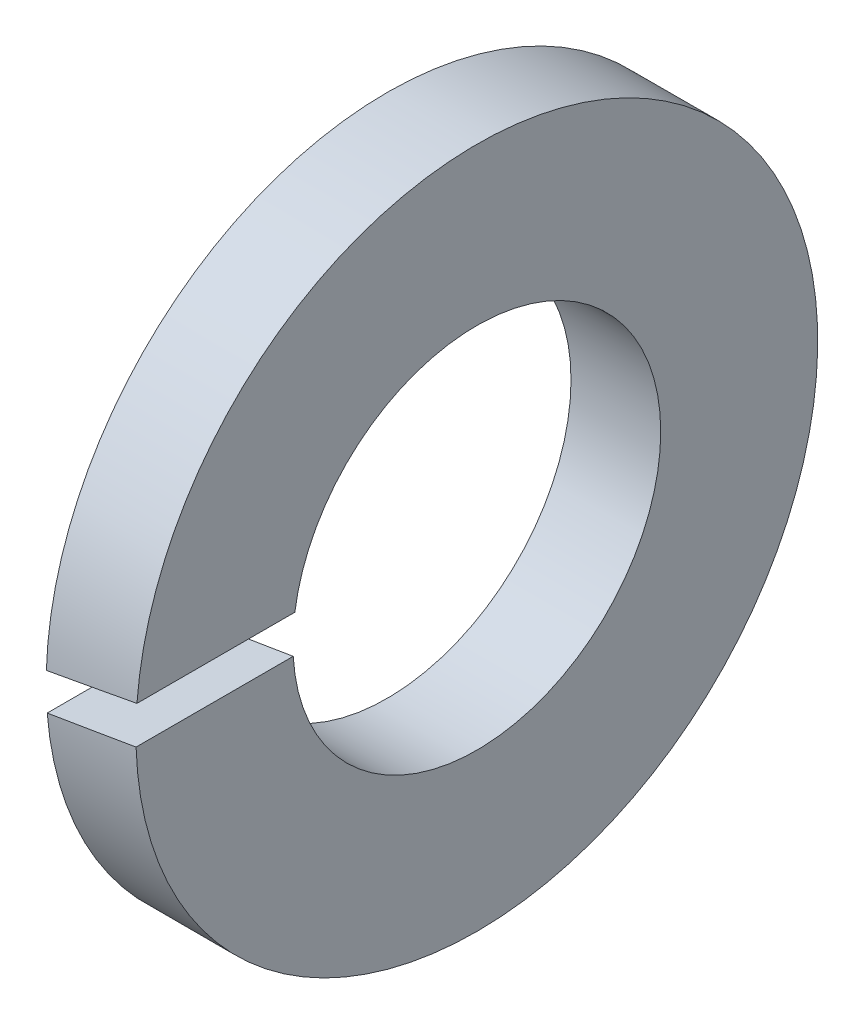
ISO-10303-21;
HEADER;
FILE_DESCRIPTION(('STEP AP214'),'2;1');
FILE_NAME('part.step','',(''),(''),'','','');
FILE_SCHEMA(('AUTOMOTIVE_DESIGN { 1 0 10303 214 1 1 1 1 }'));
ENDSEC;
DATA;
#1=APPLICATION_CONTEXT('core data for automotive mechanical design processes');
#2=APPLICATION_PROTOCOL_DEFINITION('international standard','automotive_design',2000,#1);
#3=PRODUCT_CONTEXT('',#1,'mechanical');
#4=PRODUCT('Part','Part','',(#3));
#5=PRODUCT_RELATED_PRODUCT_CATEGORY('part','',(#4));
#6=PRODUCT_DEFINITION_FORMATION('','',#4);
#7=PRODUCT_DEFINITION_CONTEXT('part definition',#1,'design');
#8=PRODUCT_DEFINITION('design','',#6,#7);
#9=PRODUCT_DEFINITION_SHAPE('','',#8);
#10=(LENGTH_UNIT() NAMED_UNIT(*) SI_UNIT(.MILLI.,.METRE.));
#11=(NAMED_UNIT(*) PLANE_ANGLE_UNIT() SI_UNIT($,.RADIAN.));
#12=(NAMED_UNIT(*) SI_UNIT($,.STERADIAN.) SOLID_ANGLE_UNIT());
#13=UNCERTAINTY_MEASURE_WITH_UNIT(LENGTH_MEASURE(1.E-05),#10,'distance_accuracy_value','');
#14=(GEOMETRIC_REPRESENTATION_CONTEXT(3) GLOBAL_UNCERTAINTY_ASSIGNED_CONTEXT((#13)) GLOBAL_UNIT_ASSIGNED_CONTEXT((#10,
#11,#12)) REPRESENTATION_CONTEXT('',''));
#15=CARTESIAN_POINT('',(0.,0.,0.));
#16=DIRECTION('',(0.,0.,1.));
#17=DIRECTION('',(1.,0.,0.));
#18=AXIS2_PLACEMENT_3D('',#15,#16,#17);
#19=CARTESIAN_POINT('',(0.5,2.925,0.));
#20=DIRECTION('',(1.,0.,0.));
#21=DIRECTION('',(0.,0.,-1.));
#22=AXIS2_PLACEMENT_3D('',#19,#20,#21);
#23=PLANE('',#22);
#24=CARTESIAN_POINT('',(0.5,0.,0.));
#25=DIRECTION('',(1.,0.,0.));
#26=DIRECTION('',(0.,0.,-1.));
#27=AXIS2_PLACEMENT_3D('',#24,#25,#26);
#28=CIRCLE('',#27,3.8);
#29=CARTESIAN_POINT('',(0.5,0.29632594579081,3.78842855731122));
#30=VERTEX_POINT('',#29);
#31=CARTESIAN_POINT('',(0.5,-0.119998965082345,3.79810482324793));
#32=VERTEX_POINT('',#31);
#33=EDGE_CURVE('E68',#30,#32,#28,.F.);
#34=ORIENTED_EDGE('',*,*,#33,.F.);
#35=DIRECTION('',(0.,0.,1.));
#36=VECTOR('',#35,1.);
#37=CARTESIAN_POINT('',(0.5,0.29632594579081,0.));
#38=LINE('',#37,#36);
#39=CARTESIAN_POINT('',(0.5,0.29632594579081,2.028470096859));
#40=VERTEX_POINT('',#39);
#41=EDGE_CURVE('E63',#30,#40,#38,.F.);
#42=ORIENTED_EDGE('',*,*,#41,.T.);
#43=CARTESIAN_POINT('',(0.5,0.,0.));
#44=DIRECTION('',(1.,0.,0.));
#45=DIRECTION('',(0.,0.,-1.));
#46=AXIS2_PLACEMENT_3D('',#43,#44,#45);
#47=CIRCLE('',#46,2.05);
#48=CARTESIAN_POINT('',(0.5,-0.119998965082345,2.04648485173459));
#49=VERTEX_POINT('',#48);
#50=EDGE_CURVE('E67',#40,#49,#47,.F.);
#51=ORIENTED_EDGE('',*,*,#50,.T.);
#52=DIRECTION('',(0.,0.,1.));
#53=VECTOR('',#52,1.);
#54=CARTESIAN_POINT('',(0.5,-0.119998965082345,0.));
#55=LINE('',#54,#53);
#56=EDGE_CURVE('E83',#49,#32,#55,.T.);
#57=ORIENTED_EDGE('',*,*,#56,.T.);
#58=EDGE_LOOP('',(#34,#42,#51,#57));
#59=FACE_BOUND('',#58,.T.);
#60=ADVANCED_FACE('F18',(#59),#23,.T.);
#61=CARTESIAN_POINT('',(-1.02040562943393,0.0282374117005723,0.));
#62=DIRECTION('',(-0.17364817766693,0.984807753012208,0.));
#63=DIRECTION('',(-0.984807753012208,-0.17364817766693,0.));
#64=AXIS2_PLACEMENT_3D('',#61,#62,#63);
#65=PLANE('',#64);
#66=CARTESIAN_POINT('',(-1.18054794904445,0.,0.));
#67=DIRECTION('',(-0.17364817766693,0.984807753012208,0.));
#68=DIRECTION('',(0.984807753012208,0.17364817766693,0.));
#69=AXIS2_PLACEMENT_3D('',#66,#67,#68);
#70=ELLIPSE('',#69,21.8833278359458,3.8);
#71=CARTESIAN_POINT('',(-0.5,0.119998965082345,3.79810482324793));
#72=VERTEX_POINT('',#71);
#73=EDGE_CURVE('E21',#72,#30,#70,.T.);
#74=ORIENTED_EDGE('',*,*,#73,.F.);
#75=DIRECTION('',(0.,0.,1.));
#76=VECTOR('',#75,1.);
#77=CARTESIAN_POINT('',(-0.5,0.119998965082345,0.));
#78=LINE('',#77,#76);
#79=CARTESIAN_POINT('',(-0.5,0.119998965082345,2.04648485173459));
#80=VERTEX_POINT('',#79);
#81=EDGE_CURVE('E73',#80,#72,#78,.T.);
#82=ORIENTED_EDGE('',*,*,#81,.F.);
#83=CARTESIAN_POINT('',(-1.18054794904445,0.,0.));
#84=DIRECTION('',(-0.17364817766693,0.984807753012208,0.));
#85=DIRECTION('',(0.984807753012208,0.17364817766693,0.));
#86=AXIS2_PLACEMENT_3D('',#83,#84,#85);
#87=ELLIPSE('',#86,11.8054794904445,2.05);
#88=EDGE_CURVE('E71',#80,#40,#87,.T.);
#89=ORIENTED_EDGE('',*,*,#88,.T.);
#90=ORIENTED_EDGE('',*,*,#41,.F.);
#91=EDGE_LOOP('',(#74,#82,#89,#90));
#92=FACE_BOUND('',#91,.T.);
#93=ADVANCED_FACE('F72',(#92),#65,.F.);
#94=CARTESIAN_POINT('',(0.,0.,0.));
#95=DIRECTION('',(1.,0.,0.));
#96=DIRECTION('',(0.,0.,-1.));
#97=AXIS2_PLACEMENT_3D('',#94,#95,#96);
#98=CYLINDRICAL_SURFACE('',#97,3.8);
#99=CARTESIAN_POINT('',(1.18054794904445,0.,0.));
#100=DIRECTION('',(0.17364817766693,-0.984807753012208,0.));
#101=DIRECTION('',(0.984807753012208,0.17364817766693,0.));
#102=AXIS2_PLACEMENT_3D('',#99,#100,#101);
#103=ELLIPSE('',#102,21.8833278359458,3.8);
#104=CARTESIAN_POINT('',(-0.5,-0.29632594579081,3.78842855731122));
#105=VERTEX_POINT('',#104);
#106=EDGE_CURVE('E84',#32,#105,#103,.T.);
#107=ORIENTED_EDGE('',*,*,#106,.T.);
#108=CARTESIAN_POINT('',(-0.5,0.,0.));
#109=DIRECTION('',(1.,0.,0.));
#110=DIRECTION('',(0.,0.,-1.));
#111=AXIS2_PLACEMENT_3D('',#108,#109,#110);
#112=CIRCLE('',#111,3.8);
#113=EDGE_CURVE('E78',#72,#105,#112,.F.);
#114=ORIENTED_EDGE('',*,*,#113,.F.);
#115=ORIENTED_EDGE('',*,*,#73,.T.);
#116=ORIENTED_EDGE('',*,*,#33,.T.);
#117=EDGE_LOOP('',(#107,#114,#115,#116));
#118=FACE_BOUND('',#117,.T.);
#119=ADVANCED_FACE('F92',(#118),#98,.T.);
#120=CARTESIAN_POINT('',(1.02040562943393,-0.0282374117005723,0.));
#121=DIRECTION('',(0.17364817766693,-0.984807753012208,0.));
#122=DIRECTION('',(0.984807753012208,0.17364817766693,0.));
#123=AXIS2_PLACEMENT_3D('',#120,#121,#122);
#124=PLANE('',#123);
#125=CARTESIAN_POINT('',(1.18054794904445,0.,0.));
#126=DIRECTION('',(0.17364817766693,-0.984807753012208,0.));
#127=DIRECTION('',(0.984807753012208,0.17364817766693,0.));
#128=AXIS2_PLACEMENT_3D('',#125,#126,#127);
#129=ELLIPSE('',#128,11.8054794904445,2.05);
#130=CARTESIAN_POINT('',(-0.5,-0.29632594579081,2.028470096859));
#131=VERTEX_POINT('',#130);
#132=EDGE_CURVE('E36',#49,#131,#129,.T.);
#133=ORIENTED_EDGE('',*,*,#132,.T.);
#134=DIRECTION('',(0.,0.,1.));
#135=VECTOR('',#134,1.);
#136=CARTESIAN_POINT('',(-0.5,-0.29632594579081,0.));
#137=LINE('',#136,#135);
#138=EDGE_CURVE('E27',#105,#131,#137,.F.);
#139=ORIENTED_EDGE('',*,*,#138,.F.);
#140=ORIENTED_EDGE('',*,*,#106,.F.);
#141=ORIENTED_EDGE('',*,*,#56,.F.);
#142=EDGE_LOOP('',(#133,#139,#140,#141));
#143=FACE_BOUND('',#142,.T.);
#144=ADVANCED_FACE('F101',(#143),#124,.F.);
#145=CARTESIAN_POINT('',(0.,0.,0.));
#146=DIRECTION('',(1.,0.,0.));
#147=DIRECTION('',(0.,0.,-1.));
#148=AXIS2_PLACEMENT_3D('',#145,#146,#147);
#149=CYLINDRICAL_SURFACE('',#148,2.05);
#150=ORIENTED_EDGE('',*,*,#50,.F.);
#151=ORIENTED_EDGE('',*,*,#88,.F.);
#152=CARTESIAN_POINT('',(-0.5,0.,0.));
#153=DIRECTION('',(1.,0.,0.));
#154=DIRECTION('',(0.,0.,-1.));
#155=AXIS2_PLACEMENT_3D('',#152,#153,#154);
#156=CIRCLE('',#155,2.05);
#157=EDGE_CURVE('E11',#131,#80,#156,.T.);
#158=ORIENTED_EDGE('',*,*,#157,.F.);
#159=ORIENTED_EDGE('',*,*,#132,.F.);
#160=EDGE_LOOP('',(#150,#151,#158,#159));
#161=FACE_BOUND('',#160,.T.);
#162=ADVANCED_FACE('F76',(#161),#149,.F.);
#163=CARTESIAN_POINT('',(-0.5,2.925,0.));
#164=DIRECTION('',(-1.,0.,0.));
#165=DIRECTION('',(0.,0.,1.));
#166=AXIS2_PLACEMENT_3D('',#163,#164,#165);
#167=PLANE('',#166);
#168=ORIENTED_EDGE('',*,*,#157,.T.);
#169=ORIENTED_EDGE('',*,*,#81,.T.);
#170=ORIENTED_EDGE('',*,*,#113,.T.);
#171=ORIENTED_EDGE('',*,*,#138,.T.);
#172=EDGE_LOOP('',(#168,#169,#170,#171));
#173=FACE_BOUND('',#172,.T.);
#174=ADVANCED_FACE('F94',(#173),#167,.T.);
#175=CLOSED_SHELL('',(#60,#93,#119,#144,#162,#174));
#176=MANIFOLD_SOLID_BREP('B1',#175);
#177=ADVANCED_BREP_SHAPE_REPRESENTATION('',(#18,#176),#14);
#178=SHAPE_DEFINITION_REPRESENTATION(#9,#177);
ENDSEC;
END-ISO-10303-21;
